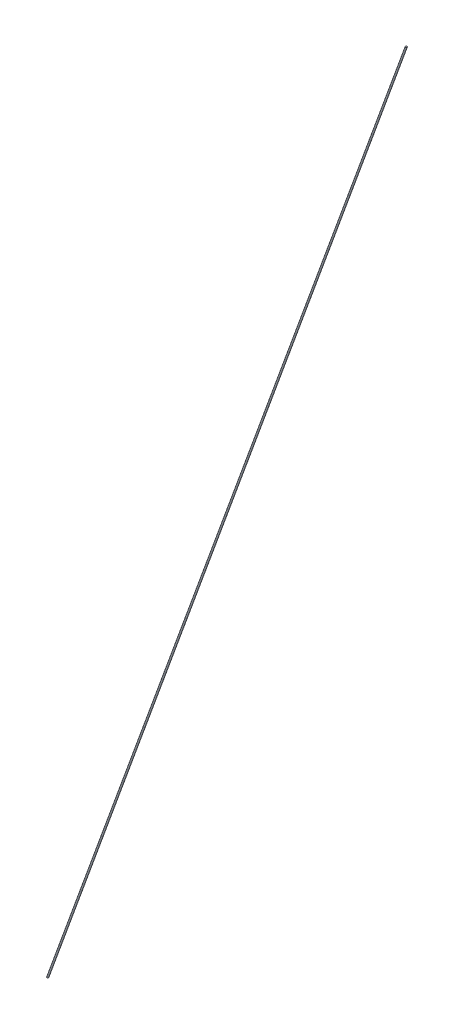
ISO-10303-21;
HEADER;
FILE_DESCRIPTION(('STEP AP214'),'2;1');
FILE_NAME('part.step','',(''),(''),'','','');
FILE_SCHEMA(('AUTOMOTIVE_DESIGN { 1 0 10303 214 1 1 1 1 }'));
ENDSEC;
DATA;
#1=APPLICATION_CONTEXT('core data for automotive mechanical design processes');
#2=APPLICATION_PROTOCOL_DEFINITION('international standard','automotive_design',2000,#1);
#3=PRODUCT_CONTEXT('',#1,'mechanical');
#4=PRODUCT('Part','Part','',(#3));
#5=PRODUCT_RELATED_PRODUCT_CATEGORY('part','',(#4));
#6=PRODUCT_DEFINITION_FORMATION('','',#4);
#7=PRODUCT_DEFINITION_CONTEXT('part definition',#1,'design');
#8=PRODUCT_DEFINITION('design','',#6,#7);
#9=PRODUCT_DEFINITION_SHAPE('','',#8);
#10=(LENGTH_UNIT() NAMED_UNIT(*) SI_UNIT(.MILLI.,.METRE.));
#11=(NAMED_UNIT(*) PLANE_ANGLE_UNIT() SI_UNIT($,.RADIAN.));
#12=(NAMED_UNIT(*) SI_UNIT($,.STERADIAN.) SOLID_ANGLE_UNIT());
#13=UNCERTAINTY_MEASURE_WITH_UNIT(LENGTH_MEASURE(1.E-05),#10,'distance_accuracy_value','');
#14=(GEOMETRIC_REPRESENTATION_CONTEXT(3) GLOBAL_UNCERTAINTY_ASSIGNED_CONTEXT((#13)) GLOBAL_UNIT_ASSIGNED_CONTEXT((#10,
#11,#12)) REPRESENTATION_CONTEXT('',''));
#15=CARTESIAN_POINT('',(0.,0.,0.));
#16=DIRECTION('',(0.,0.,1.));
#17=DIRECTION('',(1.,0.,0.));
#18=AXIS2_PLACEMENT_3D('',#15,#16,#17);
#19=CARTESIAN_POINT('',(54.5710653753274,298.378202545697,0.));
#20=DIRECTION('',(-0.342020143325673,-0.939692620785907,0.));
#21=DIRECTION('',(0.939692620785907,-0.342020143325673,0.));
#22=AXIS2_PLACEMENT_3D('',#19,#20,#21);
#23=CONICAL_SURFACE('',#22,0.,1.22173047639594);
#24=CARTESIAN_POINT('',(54.5476698196393,298.313923784728,0.));
#25=DIRECTION('',(-0.342020143325673,-0.939692620785907,0.));
#26=DIRECTION('',(0.939692620785907,-0.342020143325673,0.));
#27=AXIS2_PLACEMENT_3D('',#24,#25,#26);
#28=CIRCLE('',#27,0.187938524157202);
#29=CARTESIAN_POINT('',(54.7242742639512,298.249645023759,0.));
#30=VERTEX_POINT('',#29);
#31=EDGE_CURVE('E11',#30,#30,#28,.T.);
#32=ORIENTED_EDGE('',*,*,#31,.F.);
#33=EDGE_LOOP('',(#32));
#34=FACE_BOUND('',#33,.T.);
#35=CARTESIAN_POINT('',(54.5710653753274,298.378202545697,0.));
#36=VERTEX_POINT('',#35);
#37=VERTEX_LOOP('',#36);
#38=FACE_BOUND('',#37,.T.);
#39=ADVANCED_FACE('F35',(#34,#38),#23,.T.);
#40=CARTESIAN_POINT('',(-30.704947918426,64.0842816,0.));
#41=DIRECTION('',(-0.342020143325673,-0.939692620785907,0.));
#42=DIRECTION('',(0.939692620785907,-0.342020143325673,0.));
#43=AXIS2_PLACEMENT_3D('',#40,#41,#42);
#44=CYLINDRICAL_SURFACE('',#43,0.187938524157186);
#45=CARTESIAN_POINT('',(-30.7283434741141,64.0200028390314,0.));
#46=DIRECTION('',(-0.342020143325673,-0.939692620785907,0.));
#47=DIRECTION('',(0.939692620785907,-0.342020143325673,0.));
#48=AXIS2_PLACEMENT_3D('',#45,#46,#47);
#49=CIRCLE('',#48,0.18793852415718);
#50=CARTESIAN_POINT('',(-30.5517390298022,63.9557240780627,0.));
#51=VERTEX_POINT('',#50);
#52=EDGE_CURVE('E42',#51,#51,#49,.T.);
#53=ORIENTED_EDGE('',*,*,#52,.F.);
#54=EDGE_LOOP('',(#53));
#55=FACE_BOUND('',#54,.T.);
#56=ORIENTED_EDGE('',*,*,#31,.T.);
#57=EDGE_LOOP('',(#56));
#58=FACE_BOUND('',#57,.T.);
#59=ADVANCED_FACE('F51',(#55,#58),#44,.T.);
#60=CARTESIAN_POINT('',(-30.7283434741141,64.0200028390314,0.));
#61=DIRECTION('',(-0.342020143325673,-0.939692620785907,0.));
#62=DIRECTION('',(0.939692620785907,-0.342020143325673,0.));
#63=AXIS2_PLACEMENT_3D('',#60,#61,#62);
#64=CONICAL_SURFACE('',#63,0.187938524157179,1.22173047639604);
#65=CARTESIAN_POINT('',(-30.704947918426,64.0842816,0.));
#66=VERTEX_POINT('',#65);
#67=VERTEX_LOOP('',#66);
#68=FACE_BOUND('',#67,.T.);
#69=ORIENTED_EDGE('',*,*,#52,.T.);
#70=EDGE_LOOP('',(#69));
#71=FACE_BOUND('',#70,.T.);
#72=ADVANCED_FACE('F48',(#68,#71),#64,.F.);
#73=CLOSED_SHELL('',(#39,#59,#72));
#74=MANIFOLD_SOLID_BREP('B2',#73);
#75=ADVANCED_BREP_SHAPE_REPRESENTATION('',(#18,#74),#14);
#76=SHAPE_DEFINITION_REPRESENTATION(#9,#75);
ENDSEC;
END-ISO-10303-21;
